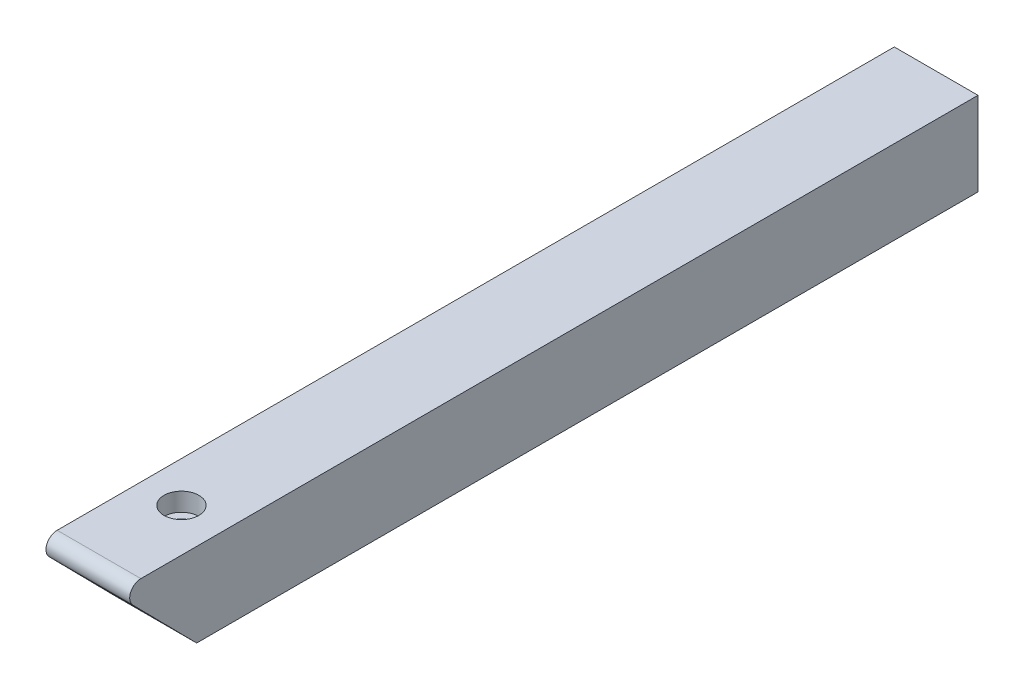
ISO-10303-21;
HEADER;
FILE_DESCRIPTION(('STEP AP214'),'2;1');
FILE_NAME('part.step','',(''),(''),'','','');
FILE_SCHEMA(('AUTOMOTIVE_DESIGN { 1 0 10303 214 1 1 1 1 }'));
ENDSEC;
DATA;
#1=APPLICATION_CONTEXT('core data for automotive mechanical design processes');
#2=APPLICATION_PROTOCOL_DEFINITION('international standard','automotive_design',2000,#1);
#3=PRODUCT_CONTEXT('',#1,'mechanical');
#4=PRODUCT('Part','Part','',(#3));
#5=PRODUCT_RELATED_PRODUCT_CATEGORY('part','',(#4));
#6=PRODUCT_DEFINITION_FORMATION('','',#4);
#7=PRODUCT_DEFINITION_CONTEXT('part definition',#1,'design');
#8=PRODUCT_DEFINITION('design','',#6,#7);
#9=PRODUCT_DEFINITION_SHAPE('','',#8);
#10=(LENGTH_UNIT() NAMED_UNIT(*) SI_UNIT(.MILLI.,.METRE.));
#11=(NAMED_UNIT(*) PLANE_ANGLE_UNIT() SI_UNIT($,.RADIAN.));
#12=(NAMED_UNIT(*) SI_UNIT($,.STERADIAN.) SOLID_ANGLE_UNIT());
#13=UNCERTAINTY_MEASURE_WITH_UNIT(LENGTH_MEASURE(1.E-05),#10,'distance_accuracy_value','');
#14=(GEOMETRIC_REPRESENTATION_CONTEXT(3) GLOBAL_UNCERTAINTY_ASSIGNED_CONTEXT((#13)) GLOBAL_UNIT_ASSIGNED_CONTEXT((#10,
#11,#12)) REPRESENTATION_CONTEXT('',''));
#15=CARTESIAN_POINT('',(0.,0.,0.));
#16=DIRECTION('',(0.,0.,1.));
#17=DIRECTION('',(1.,0.,0.));
#18=AXIS2_PLACEMENT_3D('',#15,#16,#17);
#19=CARTESIAN_POINT('',(0.,19.05,177.8));
#20=DIRECTION('',(0.,-1.,0.));
#21=DIRECTION('',(0.,0.,-1.));
#22=AXIS2_PLACEMENT_3D('',#19,#20,#21);
#23=PLANE('',#22);
#24=DIRECTION('',(-1.,0.,0.));
#25=VECTOR('',#24,1.);
#26=CARTESIAN_POINT('',(0.,19.05,0.));
#27=LINE('',#26,#25);
#28=CARTESIAN_POINT('',(19.05,19.05,0.));
#29=VERTEX_POINT('',#28);
#30=CARTESIAN_POINT('',(0.,19.05,0.));
#31=VERTEX_POINT('',#30);
#32=EDGE_CURVE('E93',#29,#31,#27,.T.);
#33=ORIENTED_EDGE('',*,*,#32,.T.);
#34=DIRECTION('',(0.,0.,-1.));
#35=VECTOR('',#34,1.);
#36=CARTESIAN_POINT('',(0.,19.05,177.8));
#37=LINE('',#36,#35);
#38=CARTESIAN_POINT('',(0.,19.05,190.5));
#39=VERTEX_POINT('',#38);
#40=EDGE_CURVE('E98',#39,#31,#37,.T.);
#41=ORIENTED_EDGE('',*,*,#40,.F.);
#42=DIRECTION('',(1.,0.,0.));
#43=VECTOR('',#42,1.);
#44=CARTESIAN_POINT('',(-24.3959033446192,19.05,190.5));
#45=LINE('',#44,#43);
#46=CARTESIAN_POINT('',(19.05,19.05,190.5));
#47=VERTEX_POINT('',#46);
#48=EDGE_CURVE('E183',#39,#47,#45,.T.);
#49=ORIENTED_EDGE('',*,*,#48,.T.);
#50=DIRECTION('',(0.,0.,-1.));
#51=VECTOR('',#50,1.);
#52=CARTESIAN_POINT('',(19.05,19.05,177.8));
#53=LINE('',#52,#51);
#54=EDGE_CURVE('E100',#47,#29,#53,.T.);
#55=ORIENTED_EDGE('',*,*,#54,.T.);
#56=EDGE_LOOP('',(#33,#41,#49,#55));
#57=FACE_BOUND('',#56,.T.);
#58=CARTESIAN_POINT('',(9.23608704013096,19.05,171.45));
#59=DIRECTION('',(0.,1.,0.));
#60=DIRECTION('',(0.,0.,1.));
#61=AXIS2_PLACEMENT_3D('',#58,#59,#60);
#62=CIRCLE('',#61,3.96875);
#63=CARTESIAN_POINT('',(9.23608704013096,19.05,175.41875));
#64=VERTEX_POINT('',#63);
#65=EDGE_CURVE('E243',#64,#64,#62,.T.);
#66=ORIENTED_EDGE('',*,*,#65,.F.);
#67=EDGE_LOOP('',(#66));
#68=FACE_BOUND('',#67,.T.);
#69=ADVANCED_FACE('F46',(#57,#68),#23,.F.);
#70=CARTESIAN_POINT('',(0.,0.,177.8));
#71=DIRECTION('',(1.,0.,0.));
#72=DIRECTION('',(0.,0.,-1.));
#73=AXIS2_PLACEMENT_3D('',#70,#71,#72);
#74=PLANE('',#73);
#75=DIRECTION('',(0.,-1.,0.));
#76=VECTOR('',#75,1.);
#77=CARTESIAN_POINT('',(0.,0.,0.));
#78=LINE('',#77,#76);
#79=CARTESIAN_POINT('',(0.,0.,0.));
#80=VERTEX_POINT('',#79);
#81=EDGE_CURVE('E109',#31,#80,#78,.T.);
#82=ORIENTED_EDGE('',*,*,#81,.T.);
#83=DIRECTION('',(0.,0.,-1.));
#84=VECTOR('',#83,1.);
#85=CARTESIAN_POINT('',(0.,0.,177.8));
#86=LINE('',#85,#84);
#87=CARTESIAN_POINT('',(0.,0.,177.8));
#88=VERTEX_POINT('',#87);
#89=EDGE_CURVE('E12',#88,#80,#86,.T.);
#90=ORIENTED_EDGE('',*,*,#89,.F.);
#91=DIRECTION('',(0.,0.712359359662811,0.701814892048316));
#92=VECTOR('',#91,1.);
#93=CARTESIAN_POINT('',(0.,14.7273901741973,192.309392773544));
#94=LINE('',#93,#92);
#95=CARTESIAN_POINT('',(0.,14.7273901741973,192.309392773544));
#96=VERTEX_POINT('',#95);
#97=EDGE_CURVE('E119',#88,#96,#94,.T.);
#98=ORIENTED_EDGE('',*,*,#97,.T.);
#99=CARTESIAN_POINT('',(0.,16.51,190.5));
#100=DIRECTION('',(1.,0.,0.));
#101=DIRECTION('',(0.,0.,-1.));
#102=AXIS2_PLACEMENT_3D('',#99,#100,#101);
#103=CIRCLE('',#102,2.54000000000001);
#104=EDGE_CURVE('E112',#96,#39,#103,.F.);
#105=ORIENTED_EDGE('',*,*,#104,.T.);
#106=ORIENTED_EDGE('',*,*,#40,.T.);
#107=EDGE_LOOP('',(#82,#90,#98,#105,#106));
#108=FACE_BOUND('',#107,.T.);
#109=ADVANCED_FACE('F48',(#108),#74,.F.);
#110=CARTESIAN_POINT('',(0.,0.,177.8));
#111=DIRECTION('',(0.,1.,0.));
#112=DIRECTION('',(0.,0.,1.));
#113=AXIS2_PLACEMENT_3D('',#110,#111,#112);
#114=PLANE('',#113);
#115=CARTESIAN_POINT('',(9.23608704013096,0.,171.45));
#116=DIRECTION('',(0.,1.,0.));
#117=DIRECTION('',(0.,0.,1.));
#118=AXIS2_PLACEMENT_3D('',#115,#116,#117);
#119=CIRCLE('',#118,2.15265);
#120=CARTESIAN_POINT('',(9.23608704013096,0.,173.60265));
#121=VERTEX_POINT('',#120);
#122=EDGE_CURVE('E147',#121,#121,#119,.T.);
#123=ORIENTED_EDGE('',*,*,#122,.T.);
#124=EDGE_LOOP('',(#123));
#125=FACE_BOUND('',#124,.T.);
#126=DIRECTION('',(1.,0.,0.));
#127=VECTOR('',#126,1.);
#128=CARTESIAN_POINT('',(0.,0.,0.));
#129=LINE('',#128,#127);
#130=CARTESIAN_POINT('',(19.05,0.,0.));
#131=VERTEX_POINT('',#130);
#132=EDGE_CURVE('E117',#80,#131,#129,.T.);
#133=ORIENTED_EDGE('',*,*,#132,.T.);
#134=DIRECTION('',(0.,0.,-1.));
#135=VECTOR('',#134,1.);
#136=CARTESIAN_POINT('',(19.05,0.,177.8));
#137=LINE('',#136,#135);
#138=CARTESIAN_POINT('',(19.05,0.,177.8));
#139=VERTEX_POINT('',#138);
#140=EDGE_CURVE('E57',#139,#131,#137,.T.);
#141=ORIENTED_EDGE('',*,*,#140,.F.);
#142=DIRECTION('',(1.,0.,0.));
#143=VECTOR('',#142,1.);
#144=CARTESIAN_POINT('',(0.,0.,177.8));
#145=LINE('',#144,#143);
#146=EDGE_CURVE('E104',#88,#139,#145,.T.);
#147=ORIENTED_EDGE('',*,*,#146,.F.);
#148=ORIENTED_EDGE('',*,*,#89,.T.);
#149=EDGE_LOOP('',(#133,#141,#147,#148));
#150=FACE_BOUND('',#149,.T.);
#151=ADVANCED_FACE('F222',(#125,#150),#114,.F.);
#152=CARTESIAN_POINT('',(19.05,0.,177.8));
#153=DIRECTION('',(-1.,0.,0.));
#154=DIRECTION('',(0.,0.,1.));
#155=AXIS2_PLACEMENT_3D('',#152,#153,#154);
#156=PLANE('',#155);
#157=DIRECTION('',(0.,1.,0.));
#158=VECTOR('',#157,1.);
#159=CARTESIAN_POINT('',(19.05,0.,0.));
#160=LINE('',#159,#158);
#161=EDGE_CURVE('E86',#131,#29,#160,.T.);
#162=ORIENTED_EDGE('',*,*,#161,.T.);
#163=ORIENTED_EDGE('',*,*,#54,.F.);
#164=CARTESIAN_POINT('',(19.05,16.51,190.5));
#165=DIRECTION('',(1.,0.,0.));
#166=DIRECTION('',(0.,0.,-1.));
#167=AXIS2_PLACEMENT_3D('',#164,#165,#166);
#168=CIRCLE('',#167,2.54000000000001);
#169=CARTESIAN_POINT('',(19.05,14.7273901741973,192.309392773544));
#170=VERTEX_POINT('',#169);
#171=EDGE_CURVE('E141',#47,#170,#168,.T.);
#172=ORIENTED_EDGE('',*,*,#171,.T.);
#173=DIRECTION('',(0.,-0.712359359662811,-0.701814892048316));
#174=VECTOR('',#173,1.);
#175=CARTESIAN_POINT('',(19.05,14.7273901741973,192.309392773544));
#176=LINE('',#175,#174);
#177=EDGE_CURVE('E146',#170,#139,#176,.T.);
#178=ORIENTED_EDGE('',*,*,#177,.T.);
#179=ORIENTED_EDGE('',*,*,#140,.T.);
#180=EDGE_LOOP('',(#162,#163,#172,#178,#179));
#181=FACE_BOUND('',#180,.T.);
#182=ADVANCED_FACE('F191',(#181),#156,.F.);
#183=CARTESIAN_POINT('',(0.,0.,0.));
#184=DIRECTION('',(0.,0.,-1.));
#185=DIRECTION('',(-1.,0.,0.));
#186=AXIS2_PLACEMENT_3D('',#183,#184,#185);
#187=PLANE('',#186);
#188=ORIENTED_EDGE('',*,*,#81,.F.);
#189=ORIENTED_EDGE('',*,*,#32,.F.);
#190=ORIENTED_EDGE('',*,*,#161,.F.);
#191=ORIENTED_EDGE('',*,*,#132,.F.);
#192=EDGE_LOOP('',(#188,#189,#190,#191));
#193=FACE_BOUND('',#192,.T.);
#194=ADVANCED_FACE('F116',(#193),#187,.T.);
#195=CARTESIAN_POINT('',(-24.3959033446192,14.7273901741973,192.309392773544));
#196=DIRECTION('',(0.,-0.701814892048316,0.712359359662811));
#197=DIRECTION('',(0.,-0.712359359662811,-0.701814892048316));
#198=AXIS2_PLACEMENT_3D('',#195,#196,#197);
#199=PLANE('',#198);
#200=ORIENTED_EDGE('',*,*,#97,.F.);
#201=ORIENTED_EDGE('',*,*,#146,.T.);
#202=ORIENTED_EDGE('',*,*,#177,.F.);
#203=DIRECTION('',(1.,0.,0.));
#204=VECTOR('',#203,1.);
#205=CARTESIAN_POINT('',(-24.3959033446192,14.7273901741973,192.309392773544));
#206=LINE('',#205,#204);
#207=EDGE_CURVE('E179',#96,#170,#206,.T.);
#208=ORIENTED_EDGE('',*,*,#207,.F.);
#209=EDGE_LOOP('',(#200,#201,#202,#208));
#210=FACE_BOUND('',#209,.T.);
#211=ADVANCED_FACE('F196',(#210),#199,.T.);
#212=CARTESIAN_POINT('',(-24.3959033446192,16.51,190.5));
#213=DIRECTION('',(1.,0.,0.));
#214=DIRECTION('',(0.,0.,-1.));
#215=AXIS2_PLACEMENT_3D('',#212,#213,#214);
#216=CYLINDRICAL_SURFACE('',#215,2.54000000000001);
#217=ORIENTED_EDGE('',*,*,#104,.F.);
#218=ORIENTED_EDGE('',*,*,#207,.T.);
#219=ORIENTED_EDGE('',*,*,#171,.F.);
#220=ORIENTED_EDGE('',*,*,#48,.F.);
#221=EDGE_LOOP('',(#217,#218,#219,#220));
#222=FACE_BOUND('',#221,.T.);
#223=ADVANCED_FACE('F203',(#222),#216,.T.);
#224=CARTESIAN_POINT('',(9.23608704013096,19.05,171.45));
#225=DIRECTION('',(0.,1.,0.));
#226=DIRECTION('',(0.,0.,1.));
#227=AXIS2_PLACEMENT_3D('',#224,#225,#226);
#228=CYLINDRICAL_SURFACE('',#227,2.15265);
#229=ORIENTED_EDGE('',*,*,#122,.F.);
#230=EDGE_LOOP('',(#229));
#231=FACE_BOUND('',#230,.T.);
#232=CARTESIAN_POINT('',(9.23608704013096,14.8844,171.45));
#233=DIRECTION('',(0.,1.,0.));
#234=DIRECTION('',(0.,0.,1.));
#235=AXIS2_PLACEMENT_3D('',#232,#233,#234);
#236=CIRCLE('',#235,2.15265);
#237=CARTESIAN_POINT('',(9.23608704013096,14.8844,173.60265));
#238=VERTEX_POINT('',#237);
#239=EDGE_CURVE('E171',#238,#238,#236,.T.);
#240=ORIENTED_EDGE('',*,*,#239,.T.);
#241=EDGE_LOOP('',(#240));
#242=FACE_BOUND('',#241,.T.);
#243=ADVANCED_FACE('F206',(#231,#242),#228,.F.);
#244=CARTESIAN_POINT('',(11.388737040131,14.8844,171.45));
#245=DIRECTION('',(0.,-1.,0.));
#246=DIRECTION('',(0.,0.,-1.));
#247=AXIS2_PLACEMENT_3D('',#244,#245,#246);
#248=PLANE('',#247);
#249=ORIENTED_EDGE('',*,*,#239,.F.);
#250=EDGE_LOOP('',(#249));
#251=FACE_BOUND('',#250,.T.);
#252=CARTESIAN_POINT('',(9.23608704013096,14.8844,171.45));
#253=DIRECTION('',(0.,1.,0.));
#254=DIRECTION('',(0.,0.,1.));
#255=AXIS2_PLACEMENT_3D('',#252,#253,#254);
#256=CIRCLE('',#255,3.96875);
#257=CARTESIAN_POINT('',(9.23608704013096,14.8844,175.41875));
#258=VERTEX_POINT('',#257);
#259=EDGE_CURVE('E175',#258,#258,#256,.T.);
#260=ORIENTED_EDGE('',*,*,#259,.T.);
#261=EDGE_LOOP('',(#260));
#262=FACE_BOUND('',#261,.T.);
#263=ADVANCED_FACE('F212',(#251,#262),#248,.F.);
#264=CARTESIAN_POINT('',(9.23608704013096,19.05,171.45));
#265=DIRECTION('',(0.,1.,0.));
#266=DIRECTION('',(0.,0.,1.));
#267=AXIS2_PLACEMENT_3D('',#264,#265,#266);
#268=CYLINDRICAL_SURFACE('',#267,3.96875);
#269=ORIENTED_EDGE('',*,*,#259,.F.);
#270=EDGE_LOOP('',(#269));
#271=FACE_BOUND('',#270,.T.);
#272=ORIENTED_EDGE('',*,*,#65,.T.);
#273=EDGE_LOOP('',(#272));
#274=FACE_BOUND('',#273,.T.);
#275=ADVANCED_FACE('F237',(#271,#274),#268,.F.);
#276=CLOSED_SHELL('',(#69,#109,#151,#182,#194,#211,#223,#243,#263,#275));
#277=MANIFOLD_SOLID_BREP('B2',#276);
#278=ADVANCED_BREP_SHAPE_REPRESENTATION('',(#18,#277),#14);
#279=SHAPE_DEFINITION_REPRESENTATION(#9,#278);
ENDSEC;
END-ISO-10303-21;
